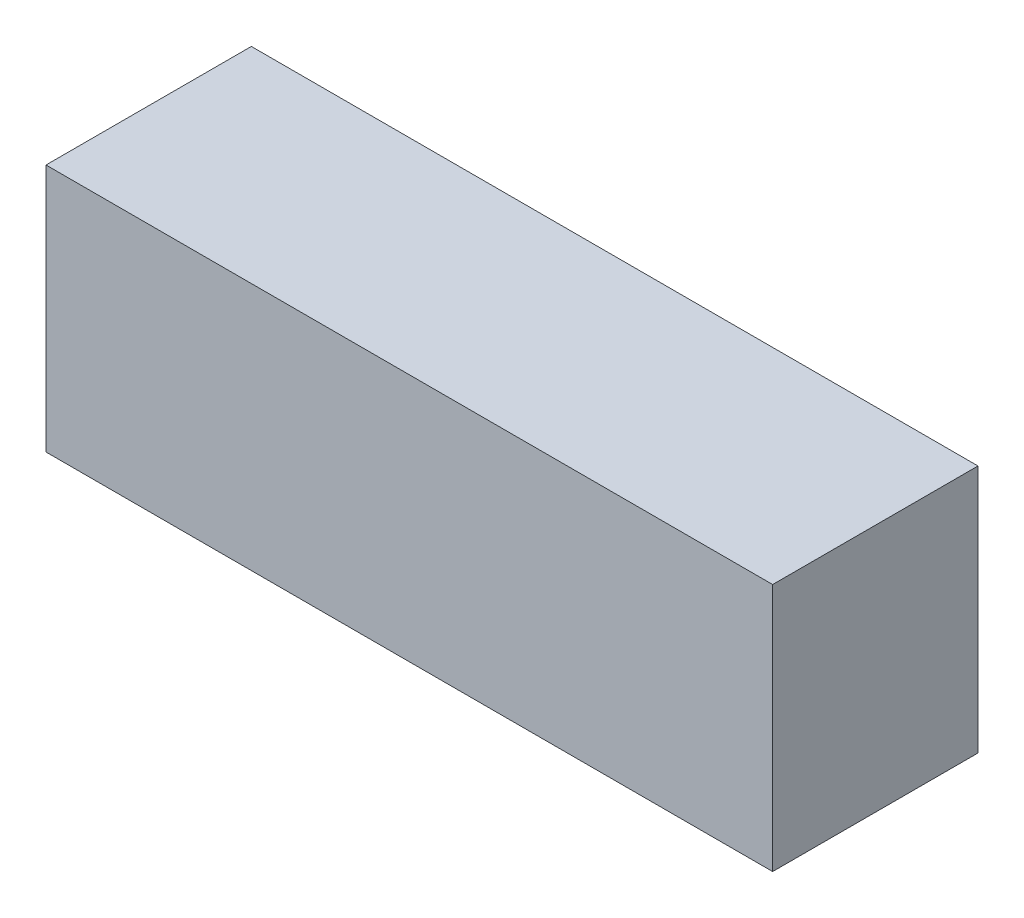
ISO-10303-21;
HEADER;
FILE_DESCRIPTION(('STEP AP214'),'2;1');
FILE_NAME('part.step','',(''),(''),'','','');
FILE_SCHEMA(('AUTOMOTIVE_DESIGN { 1 0 10303 214 1 1 1 1 }'));
ENDSEC;
DATA;
#1=APPLICATION_CONTEXT('core data for automotive mechanical design processes');
#2=APPLICATION_PROTOCOL_DEFINITION('international standard','automotive_design',2000,#1);
#3=PRODUCT_CONTEXT('',#1,'mechanical');
#4=PRODUCT('Part','Part','',(#3));
#5=PRODUCT_RELATED_PRODUCT_CATEGORY('part','',(#4));
#6=PRODUCT_DEFINITION_FORMATION('','',#4);
#7=PRODUCT_DEFINITION_CONTEXT('part definition',#1,'design');
#8=PRODUCT_DEFINITION('design','',#6,#7);
#9=PRODUCT_DEFINITION_SHAPE('','',#8);
#10=(LENGTH_UNIT() NAMED_UNIT(*) SI_UNIT(.MILLI.,.METRE.));
#11=(NAMED_UNIT(*) PLANE_ANGLE_UNIT() SI_UNIT($,.RADIAN.));
#12=(NAMED_UNIT(*) SI_UNIT($,.STERADIAN.) SOLID_ANGLE_UNIT());
#13=UNCERTAINTY_MEASURE_WITH_UNIT(LENGTH_MEASURE(1.E-05),#10,'distance_accuracy_value','');
#14=(GEOMETRIC_REPRESENTATION_CONTEXT(3) GLOBAL_UNCERTAINTY_ASSIGNED_CONTEXT((#13)) GLOBAL_UNIT_ASSIGNED_CONTEXT((#10,
#11,#12)) REPRESENTATION_CONTEXT('',''));
#15=CARTESIAN_POINT('',(0.,0.,0.));
#16=DIRECTION('',(0.,0.,1.));
#17=DIRECTION('',(1.,0.,0.));
#18=AXIS2_PLACEMENT_3D('',#15,#16,#17);
#19=CARTESIAN_POINT('',(0.,0.,1.091));
#20=DIRECTION('',(0.,0.,1.));
#21=DIRECTION('',(1.,0.,0.));
#22=AXIS2_PLACEMENT_3D('',#19,#20,#21);
#23=PLANE('',#22);
#24=DIRECTION('',(1.,0.,0.));
#25=VECTOR('',#24,1.);
#26=CARTESIAN_POINT('',(1.9304,0.6604,1.091));
#27=LINE('',#26,#25);
#28=CARTESIAN_POINT('',(-1.9304,0.660400000000001,1.091));
#29=VERTEX_POINT('',#28);
#30=CARTESIAN_POINT('',(1.9304,0.6604,1.091));
#31=VERTEX_POINT('',#30);
#32=EDGE_CURVE('E57',#29,#31,#27,.T.);
#33=ORIENTED_EDGE('',*,*,#32,.F.);
#34=DIRECTION('',(0.,-1.,0.));
#35=VECTOR('',#34,1.);
#36=CARTESIAN_POINT('',(-1.9304,0.660400000000001,1.091));
#37=LINE('',#36,#35);
#38=CARTESIAN_POINT('',(-1.9304,-0.660399999999999,1.091));
#39=VERTEX_POINT('',#38);
#40=EDGE_CURVE('E52',#39,#29,#37,.F.);
#41=ORIENTED_EDGE('',*,*,#40,.F.);
#42=DIRECTION('',(1.,0.,0.));
#43=VECTOR('',#42,1.);
#44=CARTESIAN_POINT('',(-1.9304,-0.6604,1.091));
#45=LINE('',#44,#43);
#46=CARTESIAN_POINT('',(1.9304,-0.6604,1.091));
#47=VERTEX_POINT('',#46);
#48=EDGE_CURVE('E67',#47,#39,#45,.F.);
#49=ORIENTED_EDGE('',*,*,#48,.F.);
#50=DIRECTION('',(0.,1.,0.));
#51=VECTOR('',#50,1.);
#52=CARTESIAN_POINT('',(1.9304,-0.660400000000001,1.091));
#53=LINE('',#52,#51);
#54=EDGE_CURVE('E19',#31,#47,#53,.F.);
#55=ORIENTED_EDGE('',*,*,#54,.F.);
#56=EDGE_LOOP('',(#33,#41,#49,#55));
#57=FACE_BOUND('',#56,.T.);
#58=ADVANCED_FACE('F16',(#57),#23,.T.);
#59=CARTESIAN_POINT('',(1.9304,-0.660400000000001,0.));
#60=DIRECTION('',(1.,0.,0.));
#61=DIRECTION('',(0.,1.,0.));
#62=AXIS2_PLACEMENT_3D('',#59,#60,#61);
#63=PLANE('',#62);
#64=ORIENTED_EDGE('',*,*,#54,.T.);
#65=DIRECTION('',(0.,0.,-1.));
#66=VECTOR('',#65,1.);
#67=CARTESIAN_POINT('',(1.9304,-0.660400000000001,0.));
#68=LINE('',#67,#66);
#69=CARTESIAN_POINT('',(1.9304,-0.6604,0.));
#70=VERTEX_POINT('',#69);
#71=EDGE_CURVE('E78',#70,#47,#68,.F.);
#72=ORIENTED_EDGE('',*,*,#71,.F.);
#73=DIRECTION('',(0.,1.,0.));
#74=VECTOR('',#73,1.);
#75=CARTESIAN_POINT('',(1.9304,0.,0.));
#76=LINE('',#75,#74);
#77=CARTESIAN_POINT('',(1.9304,0.6604,0.));
#78=VERTEX_POINT('',#77);
#79=EDGE_CURVE('E73',#70,#78,#76,.T.);
#80=ORIENTED_EDGE('',*,*,#79,.T.);
#81=DIRECTION('',(0.,0.,1.));
#82=VECTOR('',#81,1.);
#83=CARTESIAN_POINT('',(1.9304,0.6604,0.));
#84=LINE('',#83,#82);
#85=EDGE_CURVE('E62',#31,#78,#84,.F.);
#86=ORIENTED_EDGE('',*,*,#85,.F.);
#87=EDGE_LOOP('',(#64,#72,#80,#86));
#88=FACE_BOUND('',#87,.T.);
#89=ADVANCED_FACE('F72',(#88),#63,.T.);
#90=CARTESIAN_POINT('',(1.9304,0.6604,0.));
#91=DIRECTION('',(0.,1.,0.));
#92=DIRECTION('',(0.,0.,1.));
#93=AXIS2_PLACEMENT_3D('',#90,#91,#92);
#94=PLANE('',#93);
#95=ORIENTED_EDGE('',*,*,#32,.T.);
#96=ORIENTED_EDGE('',*,*,#85,.T.);
#97=DIRECTION('',(1.,0.,0.));
#98=VECTOR('',#97,1.);
#99=CARTESIAN_POINT('',(0.,0.6604,0.));
#100=LINE('',#99,#98);
#101=CARTESIAN_POINT('',(-1.9304,0.660400000000001,0.));
#102=VERTEX_POINT('',#101);
#103=EDGE_CURVE('E83',#78,#102,#100,.F.);
#104=ORIENTED_EDGE('',*,*,#103,.T.);
#105=DIRECTION('',(0.,0.,1.));
#106=VECTOR('',#105,1.);
#107=CARTESIAN_POINT('',(-1.9304,0.660400000000001,0.));
#108=LINE('',#107,#106);
#109=EDGE_CURVE('E64',#29,#102,#108,.F.);
#110=ORIENTED_EDGE('',*,*,#109,.F.);
#111=EDGE_LOOP('',(#95,#96,#104,#110));
#112=FACE_BOUND('',#111,.T.);
#113=ADVANCED_FACE('F59',(#112),#94,.T.);
#114=CARTESIAN_POINT('',(-1.9304,0.660400000000001,0.));
#115=DIRECTION('',(-1.,0.,0.));
#116=DIRECTION('',(0.,-1.,0.));
#117=AXIS2_PLACEMENT_3D('',#114,#115,#116);
#118=PLANE('',#117);
#119=ORIENTED_EDGE('',*,*,#40,.T.);
#120=ORIENTED_EDGE('',*,*,#109,.T.);
#121=DIRECTION('',(0.,1.,0.));
#122=VECTOR('',#121,1.);
#123=CARTESIAN_POINT('',(-1.9304,0.,0.));
#124=LINE('',#123,#122);
#125=CARTESIAN_POINT('',(-1.9304,-0.6604,0.));
#126=VERTEX_POINT('',#125);
#127=EDGE_CURVE('E25',#102,#126,#124,.F.);
#128=ORIENTED_EDGE('',*,*,#127,.T.);
#129=DIRECTION('',(0.,0.,-1.));
#130=VECTOR('',#129,1.);
#131=CARTESIAN_POINT('',(-1.9304,-0.6604,0.));
#132=LINE('',#131,#130);
#133=EDGE_CURVE('E33',#39,#126,#132,.T.);
#134=ORIENTED_EDGE('',*,*,#133,.F.);
#135=EDGE_LOOP('',(#119,#120,#128,#134));
#136=FACE_BOUND('',#135,.T.);
#137=ADVANCED_FACE('F87',(#136),#118,.T.);
#138=CARTESIAN_POINT('',(-1.9304,-0.6604,0.));
#139=DIRECTION('',(0.,-1.,0.));
#140=DIRECTION('',(0.,0.,-1.));
#141=AXIS2_PLACEMENT_3D('',#138,#139,#140);
#142=PLANE('',#141);
#143=ORIENTED_EDGE('',*,*,#48,.T.);
#144=ORIENTED_EDGE('',*,*,#133,.T.);
#145=DIRECTION('',(1.,0.,0.));
#146=VECTOR('',#145,1.);
#147=CARTESIAN_POINT('',(0.,-0.6604,0.));
#148=LINE('',#147,#146);
#149=EDGE_CURVE('E11',#126,#70,#148,.T.);
#150=ORIENTED_EDGE('',*,*,#149,.T.);
#151=ORIENTED_EDGE('',*,*,#71,.T.);
#152=EDGE_LOOP('',(#143,#144,#150,#151));
#153=FACE_BOUND('',#152,.T.);
#154=ADVANCED_FACE('F90',(#153),#142,.T.);
#155=CARTESIAN_POINT('',(0.,0.,0.));
#156=DIRECTION('',(0.,0.,1.));
#157=DIRECTION('',(1.,0.,0.));
#158=AXIS2_PLACEMENT_3D('',#155,#156,#157);
#159=PLANE('',#158);
#160=ORIENTED_EDGE('',*,*,#127,.F.);
#161=ORIENTED_EDGE('',*,*,#103,.F.);
#162=ORIENTED_EDGE('',*,*,#79,.F.);
#163=ORIENTED_EDGE('',*,*,#149,.F.);
#164=EDGE_LOOP('',(#160,#161,#162,#163));
#165=FACE_BOUND('',#164,.T.);
#166=ADVANCED_FACE('F89',(#165),#159,.F.);
#167=CLOSED_SHELL('',(#58,#89,#113,#137,#154,#166));
#168=MANIFOLD_SOLID_BREP('B1',#167);
#169=ADVANCED_BREP_SHAPE_REPRESENTATION('',(#18,#168),#14);
#170=SHAPE_DEFINITION_REPRESENTATION(#9,#169);
ENDSEC;
END-ISO-10303-21;
